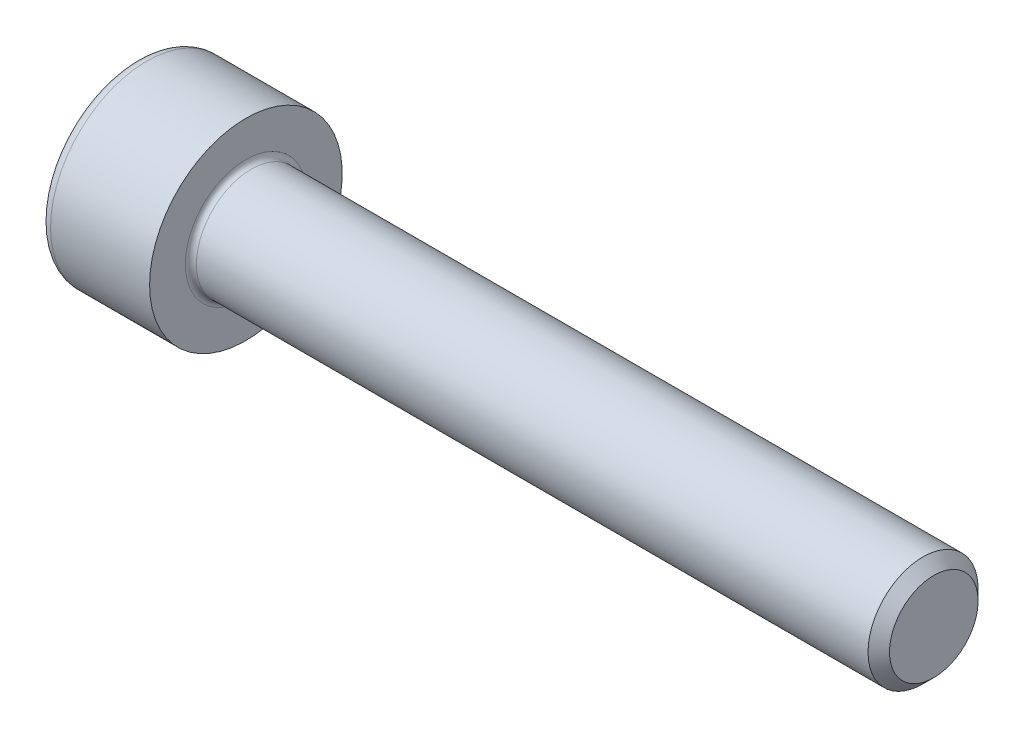
ISO-10303-21;
HEADER;
FILE_DESCRIPTION(('STEP AP214'),'2;1');
FILE_NAME('part.step','',(''),(''),'','','');
FILE_SCHEMA(('AUTOMOTIVE_DESIGN { 1 0 10303 214 1 1 1 1 }'));
ENDSEC;
DATA;
#1=APPLICATION_CONTEXT('core data for automotive mechanical design processes');
#2=APPLICATION_PROTOCOL_DEFINITION('international standard','automotive_design',2000,#1);
#3=PRODUCT_CONTEXT('',#1,'mechanical');
#4=PRODUCT('Part','Part','',(#3));
#5=PRODUCT_RELATED_PRODUCT_CATEGORY('part','',(#4));
#6=PRODUCT_DEFINITION_FORMATION('','',#4);
#7=PRODUCT_DEFINITION_CONTEXT('part definition',#1,'design');
#8=PRODUCT_DEFINITION('design','',#6,#7);
#9=PRODUCT_DEFINITION_SHAPE('','',#8);
#10=(LENGTH_UNIT() NAMED_UNIT(*) SI_UNIT(.MILLI.,.METRE.));
#11=(NAMED_UNIT(*) PLANE_ANGLE_UNIT() SI_UNIT($,.RADIAN.));
#12=(NAMED_UNIT(*) SI_UNIT($,.STERADIAN.) SOLID_ANGLE_UNIT());
#13=UNCERTAINTY_MEASURE_WITH_UNIT(LENGTH_MEASURE(1.E-05),#10,'distance_accuracy_value','');
#14=(GEOMETRIC_REPRESENTATION_CONTEXT(3) GLOBAL_UNCERTAINTY_ASSIGNED_CONTEXT((#13)) GLOBAL_UNIT_ASSIGNED_CONTEXT((#10,
#11,#12)) REPRESENTATION_CONTEXT('',''));
#15=CARTESIAN_POINT('',(0.,0.,0.));
#16=DIRECTION('',(0.,0.,1.));
#17=DIRECTION('',(1.,0.,0.));
#18=AXIS2_PLACEMENT_3D('',#15,#16,#17);
#19=CARTESIAN_POINT('',(0.,0.,0.));
#20=DIRECTION('',(-1.,0.,0.));
#21=DIRECTION('',(0.,0.,1.));
#22=AXIS2_PLACEMENT_3D('',#19,#20,#21);
#23=PLANE('',#22);
#24=DIRECTION('',(0.,-0.5,0.866025403784439));
#25=VECTOR('',#24,1.);
#26=CARTESIAN_POINT('',(0.,1.74359781295267,0.));
#27=LINE('',#26,#25);
#28=CARTESIAN_POINT('',(0.,1.74359781295267,0.));
#29=VERTEX_POINT('',#28);
#30=CARTESIAN_POINT('',(0.,0.871798906476331,1.51));
#31=VERTEX_POINT('',#30);
#32=EDGE_CURVE('E258',#29,#31,#27,.T.);
#33=ORIENTED_EDGE('',*,*,#32,.T.);
#34=DIRECTION('',(0.,1.,0.));
#35=VECTOR('',#34,1.);
#36=CARTESIAN_POINT('',(0.,-0.87179890647634,1.51));
#37=LINE('',#36,#35);
#38=CARTESIAN_POINT('',(0.,-0.87179890647634,1.51));
#39=VERTEX_POINT('',#38);
#40=EDGE_CURVE('E130',#39,#31,#37,.T.);
#41=ORIENTED_EDGE('',*,*,#40,.F.);
#42=DIRECTION('',(0.,-0.500000000000001,-0.866025403784438));
#43=VECTOR('',#42,1.);
#44=CARTESIAN_POINT('',(0.,-0.87179890647634,1.51));
#45=LINE('',#44,#43);
#46=CARTESIAN_POINT('',(0.,-1.74359781295268,0.));
#47=VERTEX_POINT('',#46);
#48=EDGE_CURVE('E261',#39,#47,#45,.T.);
#49=ORIENTED_EDGE('',*,*,#48,.T.);
#50=DIRECTION('',(0.,0.5,-0.866025403784439));
#51=VECTOR('',#50,1.);
#52=CARTESIAN_POINT('',(0.,-1.74359781295268,0.));
#53=LINE('',#52,#51);
#54=CARTESIAN_POINT('',(0.,-0.871798906476342,-1.51));
#55=VERTEX_POINT('',#54);
#56=EDGE_CURVE('E264',#47,#55,#53,.T.);
#57=ORIENTED_EDGE('',*,*,#56,.T.);
#58=DIRECTION('',(0.,-1.,0.));
#59=VECTOR('',#58,1.);
#60=CARTESIAN_POINT('',(0.,0.871798906476328,-1.51));
#61=LINE('',#60,#59);
#62=CARTESIAN_POINT('',(0.,0.871798906476328,-1.51));
#63=VERTEX_POINT('',#62);
#64=EDGE_CURVE('E267',#63,#55,#61,.T.);
#65=ORIENTED_EDGE('',*,*,#64,.F.);
#66=DIRECTION('',(0.,-0.500000000000002,-0.866025403784438));
#67=VECTOR('',#66,1.);
#68=CARTESIAN_POINT('',(0.,1.74359781295267,0.));
#69=LINE('',#68,#67);
#70=EDGE_CURVE('E125',#29,#63,#69,.T.);
#71=ORIENTED_EDGE('',*,*,#70,.F.);
#72=EDGE_LOOP('',(#33,#41,#49,#57,#65,#71));
#73=FACE_BOUND('',#72,.T.);
#74=CARTESIAN_POINT('',(0.,0.,0.));
#75=DIRECTION('',(-1.,0.,0.));
#76=DIRECTION('',(0.,0.,1.));
#77=AXIS2_PLACEMENT_3D('',#74,#75,#76);
#78=CIRCLE('',#77,3.1);
#79=CARTESIAN_POINT('',(0.,0.,3.1));
#80=VERTEX_POINT('',#79);
#81=EDGE_CURVE('E42',#80,#80,#78,.T.);
#82=ORIENTED_EDGE('',*,*,#81,.T.);
#83=EDGE_LOOP('',(#82));
#84=FACE_BOUND('',#83,.T.);
#85=ADVANCED_FACE('F34',(#73,#84),#23,.T.);
#86=CARTESIAN_POINT('',(-31.75,0.,0.));
#87=DIRECTION('',(-1.,0.,0.));
#88=DIRECTION('',(0.,0.,1.));
#89=AXIS2_PLACEMENT_3D('',#86,#87,#88);
#90=CYLINDRICAL_SURFACE('',#89,3.5);
#91=CARTESIAN_POINT('',(0.399999999999998,0.,0.));
#92=DIRECTION('',(-1.,0.,0.));
#93=DIRECTION('',(0.,0.,1.));
#94=AXIS2_PLACEMENT_3D('',#91,#92,#93);
#95=CIRCLE('',#94,3.5);
#96=CARTESIAN_POINT('',(0.399999999999998,0.,3.5));
#97=VERTEX_POINT('',#96);
#98=EDGE_CURVE('E11',#97,#97,#95,.F.);
#99=ORIENTED_EDGE('',*,*,#98,.T.);
#100=EDGE_LOOP('',(#99));
#101=FACE_BOUND('',#100,.T.);
#102=CARTESIAN_POINT('',(4.,0.,0.));
#103=DIRECTION('',(-1.,0.,0.));
#104=DIRECTION('',(0.,0.,1.));
#105=AXIS2_PLACEMENT_3D('',#102,#103,#104);
#106=CIRCLE('',#105,3.5);
#107=CARTESIAN_POINT('',(4.,0.,3.5));
#108=VERTEX_POINT('',#107);
#109=EDGE_CURVE('E148',#108,#108,#106,.T.);
#110=ORIENTED_EDGE('',*,*,#109,.T.);
#111=EDGE_LOOP('',(#110));
#112=FACE_BOUND('',#111,.T.);
#113=ADVANCED_FACE('F172',(#101,#112),#90,.T.);
#114=CARTESIAN_POINT('',(4.,3.5,0.));
#115=DIRECTION('',(1.,0.,0.));
#116=DIRECTION('',(0.,0.,-1.));
#117=AXIS2_PLACEMENT_3D('',#114,#115,#116);
#118=PLANE('',#117);
#119=CARTESIAN_POINT('',(4.,0.,0.));
#120=DIRECTION('',(1.,0.,0.));
#121=DIRECTION('',(0.,0.,-1.));
#122=AXIS2_PLACEMENT_3D('',#119,#120,#121);
#123=CIRCLE('',#122,2.19999999999999);
#124=CARTESIAN_POINT('',(4.,0.,-2.19999999999999));
#125=VERTEX_POINT('',#124);
#126=EDGE_CURVE('E151',#125,#125,#123,.F.);
#127=ORIENTED_EDGE('',*,*,#126,.T.);
#128=EDGE_LOOP('',(#127));
#129=FACE_BOUND('',#128,.T.);
#130=ORIENTED_EDGE('',*,*,#109,.F.);
#131=EDGE_LOOP('',(#130));
#132=FACE_BOUND('',#131,.T.);
#133=ADVANCED_FACE('F178',(#129,#132),#118,.T.);
#134=CARTESIAN_POINT('',(-31.75,0.,0.));
#135=DIRECTION('',(-1.,0.,0.));
#136=DIRECTION('',(0.,0.,1.));
#137=AXIS2_PLACEMENT_3D('',#134,#135,#136);
#138=CYLINDRICAL_SURFACE('',#137,1.99999999999999);
#139=CARTESIAN_POINT('',(4.2,0.,0.));
#140=DIRECTION('',(1.,0.,0.));
#141=DIRECTION('',(0.,0.,-1.));
#142=AXIS2_PLACEMENT_3D('',#139,#140,#141);
#143=CIRCLE('',#142,1.99999999999999);
#144=CARTESIAN_POINT('',(4.2,0.,-1.99999999999999));
#145=VERTEX_POINT('',#144);
#146=EDGE_CURVE('E154',#145,#145,#143,.T.);
#147=ORIENTED_EDGE('',*,*,#146,.T.);
#148=EDGE_LOOP('',(#147));
#149=FACE_BOUND('',#148,.T.);
#150=CARTESIAN_POINT('',(28.61,0.,0.));
#151=DIRECTION('',(-1.,0.,0.));
#152=DIRECTION('',(0.,0.,1.));
#153=AXIS2_PLACEMENT_3D('',#150,#151,#152);
#154=CIRCLE('',#153,1.99999999999998);
#155=CARTESIAN_POINT('',(28.61,0.,1.99999999999998));
#156=VERTEX_POINT('',#155);
#157=EDGE_CURVE('E145',#156,#156,#154,.T.);
#158=ORIENTED_EDGE('',*,*,#157,.T.);
#159=EDGE_LOOP('',(#158));
#160=FACE_BOUND('',#159,.T.);
#161=ADVANCED_FACE('F184',(#149,#160),#138,.T.);
#162=CARTESIAN_POINT('',(29.,0.,0.));
#163=DIRECTION('',(-1.,0.,0.));
#164=DIRECTION('',(0.,0.,1.));
#165=AXIS2_PLACEMENT_3D('',#162,#163,#164);
#166=CONICAL_SURFACE('',#165,1.61,0.785398163397405);
#167=ORIENTED_EDGE('',*,*,#157,.F.);
#168=EDGE_LOOP('',(#167));
#169=FACE_BOUND('',#168,.T.);
#170=CARTESIAN_POINT('',(29.,0.,0.));
#171=DIRECTION('',(-1.,0.,0.));
#172=DIRECTION('',(0.,0.,1.));
#173=AXIS2_PLACEMENT_3D('',#170,#171,#172);
#174=CIRCLE('',#173,1.61);
#175=CARTESIAN_POINT('',(29.,0.,1.61));
#176=VERTEX_POINT('',#175);
#177=EDGE_CURVE('E141',#176,#176,#174,.T.);
#178=ORIENTED_EDGE('',*,*,#177,.T.);
#179=EDGE_LOOP('',(#178));
#180=FACE_BOUND('',#179,.T.);
#181=ADVANCED_FACE('F188',(#169,#180),#166,.T.);
#182=CARTESIAN_POINT('',(29.,1.61,0.));
#183=DIRECTION('',(1.,0.,0.));
#184=DIRECTION('',(0.,0.,-1.));
#185=AXIS2_PLACEMENT_3D('',#182,#183,#184);
#186=PLANE('',#185);
#187=ORIENTED_EDGE('',*,*,#177,.F.);
#188=EDGE_LOOP('',(#187));
#189=FACE_BOUND('',#188,.T.);
#190=ADVANCED_FACE('F168',(#189),#186,.T.);
#191=CARTESIAN_POINT('',(4.2,0.,0.));
#192=DIRECTION('',(1.,0.,0.));
#193=DIRECTION('',(0.,0.,-1.));
#194=AXIS2_PLACEMENT_3D('',#191,#192,#193);
#195=TOROIDAL_SURFACE('',#194,2.19999999999999,0.2);
#196=ORIENTED_EDGE('',*,*,#146,.F.);
#197=EDGE_LOOP('',(#196));
#198=FACE_BOUND('',#197,.T.);
#199=ORIENTED_EDGE('',*,*,#126,.F.);
#200=EDGE_LOOP('',(#199));
#201=FACE_BOUND('',#200,.T.);
#202=ADVANCED_FACE('F161',(#198,#201),#195,.F.);
#203=CARTESIAN_POINT('',(0.399999999999998,0.,0.));
#204=DIRECTION('',(-1.,0.,0.));
#205=DIRECTION('',(0.,0.,1.));
#206=AXIS2_PLACEMENT_3D('',#203,#204,#205);
#207=TOROIDAL_SURFACE('',#206,3.1,0.4);
#208=ORIENTED_EDGE('',*,*,#98,.F.);
#209=EDGE_LOOP('',(#208));
#210=FACE_BOUND('',#209,.T.);
#211=ORIENTED_EDGE('',*,*,#81,.F.);
#212=EDGE_LOOP('',(#211));
#213=FACE_BOUND('',#212,.T.);
#214=ADVANCED_FACE('F36',(#210,#213),#207,.T.);
#215=CARTESIAN_POINT('',(2.,1.74359781295267,0.));
#216=DIRECTION('',(0.,-0.866025403784439,-0.5));
#217=DIRECTION('',(0.,0.5,-0.866025403784439));
#218=AXIS2_PLACEMENT_3D('',#215,#216,#217);
#219=PLANE('',#218);
#220=ORIENTED_EDGE('',*,*,#32,.F.);
#221=DIRECTION('',(-1.,0.,0.));
#222=VECTOR('',#221,1.);
#223=CARTESIAN_POINT('',(2.,1.74359781295267,0.));
#224=LINE('',#223,#222);
#225=CARTESIAN_POINT('',(2.,1.74359781295267,0.));
#226=VERTEX_POINT('',#225);
#227=EDGE_CURVE('E248',#226,#29,#224,.T.);
#228=ORIENTED_EDGE('',*,*,#227,.F.);
#229=DIRECTION('',(0.,-0.5,0.866025403784439));
#230=VECTOR('',#229,1.);
#231=CARTESIAN_POINT('',(2.,1.74359781295267,0.));
#232=LINE('',#231,#230);
#233=CARTESIAN_POINT('',(2.,1.3076983597145,0.754999999999997));
#234=VERTEX_POINT('',#233);
#235=EDGE_CURVE('E117',#226,#234,#232,.T.);
#236=ORIENTED_EDGE('',*,*,#235,.T.);
#237=CARTESIAN_POINT('',(2.,0.871798906476331,1.51));
#238=VERTEX_POINT('',#237);
#239=EDGE_CURVE('E108',#234,#238,#232,.T.);
#240=ORIENTED_EDGE('',*,*,#239,.T.);
#241=DIRECTION('',(-1.,0.,0.));
#242=VECTOR('',#241,1.);
#243=CARTESIAN_POINT('',(2.,0.871798906476331,1.51));
#244=LINE('',#243,#242);
#245=EDGE_CURVE('E122',#238,#31,#244,.T.);
#246=ORIENTED_EDGE('',*,*,#245,.T.);
#247=EDGE_LOOP('',(#220,#228,#236,#240,#246));
#248=FACE_BOUND('',#247,.T.);
#249=ADVANCED_FACE('F121',(#248),#219,.T.);
#250=CARTESIAN_POINT('',(2.,-0.87179890647634,1.51));
#251=DIRECTION('',(0.,0.,1.));
#252=DIRECTION('',(0.,-1.,0.));
#253=AXIS2_PLACEMENT_3D('',#250,#251,#252);
#254=PLANE('',#253);
#255=ORIENTED_EDGE('',*,*,#40,.T.);
#256=ORIENTED_EDGE('',*,*,#245,.F.);
#257=DIRECTION('',(0.,1.,0.));
#258=VECTOR('',#257,1.);
#259=CARTESIAN_POINT('',(2.,-0.87179890647634,1.51));
#260=LINE('',#259,#258);
#261=CARTESIAN_POINT('',(2.,0.,1.51));
#262=VERTEX_POINT('',#261);
#263=EDGE_CURVE('E105',#262,#238,#260,.T.);
#264=ORIENTED_EDGE('',*,*,#263,.F.);
#265=CARTESIAN_POINT('',(2.,-0.87179890647634,1.51));
#266=VERTEX_POINT('',#265);
#267=EDGE_CURVE('E116',#266,#262,#260,.T.);
#268=ORIENTED_EDGE('',*,*,#267,.F.);
#269=DIRECTION('',(-1.,0.,0.));
#270=VECTOR('',#269,1.);
#271=CARTESIAN_POINT('',(2.,-0.87179890647634,1.51));
#272=LINE('',#271,#270);
#273=EDGE_CURVE('E132',#266,#39,#272,.T.);
#274=ORIENTED_EDGE('',*,*,#273,.T.);
#275=EDGE_LOOP('',(#255,#256,#264,#268,#274));
#276=FACE_BOUND('',#275,.T.);
#277=ADVANCED_FACE('F127',(#276),#254,.F.);
#278=CARTESIAN_POINT('',(2.,-0.87179890647634,1.51));
#279=DIRECTION('',(0.,0.866025403784438,-0.500000000000001));
#280=DIRECTION('',(0.,0.500000000000001,0.866025403784438));
#281=AXIS2_PLACEMENT_3D('',#278,#279,#280);
#282=PLANE('',#281);
#283=ORIENTED_EDGE('',*,*,#48,.F.);
#284=ORIENTED_EDGE('',*,*,#273,.F.);
#285=DIRECTION('',(0.,-0.500000000000001,-0.866025403784438));
#286=VECTOR('',#285,1.);
#287=CARTESIAN_POINT('',(2.,-0.87179890647634,1.51));
#288=LINE('',#287,#286);
#289=CARTESIAN_POINT('',(2.,-1.30769835971451,0.755000000000004));
#290=VERTEX_POINT('',#289);
#291=EDGE_CURVE('E287',#266,#290,#288,.T.);
#292=ORIENTED_EDGE('',*,*,#291,.T.);
#293=CARTESIAN_POINT('',(2.,-1.74359781295268,0.));
#294=VERTEX_POINT('',#293);
#295=EDGE_CURVE('E276',#290,#294,#288,.T.);
#296=ORIENTED_EDGE('',*,*,#295,.T.);
#297=DIRECTION('',(-1.,0.,0.));
#298=VECTOR('',#297,1.);
#299=CARTESIAN_POINT('',(2.,-1.74359781295268,0.));
#300=LINE('',#299,#298);
#301=EDGE_CURVE('E137',#294,#47,#300,.T.);
#302=ORIENTED_EDGE('',*,*,#301,.T.);
#303=EDGE_LOOP('',(#283,#284,#292,#296,#302));
#304=FACE_BOUND('',#303,.T.);
#305=ADVANCED_FACE('F202',(#304),#282,.T.);
#306=CARTESIAN_POINT('',(2.,-1.74359781295268,0.));
#307=DIRECTION('',(0.,0.866025403784439,0.499999999999999));
#308=DIRECTION('',(0.,-0.499999999999999,0.866025403784439));
#309=AXIS2_PLACEMENT_3D('',#306,#307,#308);
#310=PLANE('',#309);
#311=ORIENTED_EDGE('',*,*,#56,.F.);
#312=ORIENTED_EDGE('',*,*,#301,.F.);
#313=DIRECTION('',(0.,0.5,-0.866025403784439));
#314=VECTOR('',#313,1.);
#315=CARTESIAN_POINT('',(2.,-1.74359781295268,0.));
#316=LINE('',#315,#314);
#317=CARTESIAN_POINT('',(2.,-1.30769835971451,-0.755000000000002));
#318=VERTEX_POINT('',#317);
#319=EDGE_CURVE('E254',#294,#318,#316,.T.);
#320=ORIENTED_EDGE('',*,*,#319,.T.);
#321=CARTESIAN_POINT('',(2.,-0.871798906476342,-1.51));
#322=VERTEX_POINT('',#321);
#323=EDGE_CURVE('E286',#318,#322,#316,.T.);
#324=ORIENTED_EDGE('',*,*,#323,.T.);
#325=DIRECTION('',(-1.,0.,0.));
#326=VECTOR('',#325,1.);
#327=CARTESIAN_POINT('',(2.,-0.871798906476342,-1.51));
#328=LINE('',#327,#326);
#329=EDGE_CURVE('E247',#322,#55,#328,.T.);
#330=ORIENTED_EDGE('',*,*,#329,.T.);
#331=EDGE_LOOP('',(#311,#312,#320,#324,#330));
#332=FACE_BOUND('',#331,.T.);
#333=ADVANCED_FACE('F205',(#332),#310,.T.);
#334=CARTESIAN_POINT('',(2.,0.871798906476328,-1.51));
#335=DIRECTION('',(0.,0.,-1.));
#336=DIRECTION('',(0.,1.,0.));
#337=AXIS2_PLACEMENT_3D('',#334,#335,#336);
#338=PLANE('',#337);
#339=ORIENTED_EDGE('',*,*,#64,.T.);
#340=ORIENTED_EDGE('',*,*,#329,.F.);
#341=DIRECTION('',(0.,-1.,0.));
#342=VECTOR('',#341,1.);
#343=CARTESIAN_POINT('',(2.,0.871798906476328,-1.51));
#344=LINE('',#343,#342);
#345=CARTESIAN_POINT('',(2.,0.,-1.51));
#346=VERTEX_POINT('',#345);
#347=EDGE_CURVE('E251',#346,#322,#344,.T.);
#348=ORIENTED_EDGE('',*,*,#347,.F.);
#349=CARTESIAN_POINT('',(2.,0.871798906476328,-1.51));
#350=VERTEX_POINT('',#349);
#351=EDGE_CURVE('E49',#350,#346,#344,.T.);
#352=ORIENTED_EDGE('',*,*,#351,.F.);
#353=DIRECTION('',(-1.,0.,0.));
#354=VECTOR('',#353,1.);
#355=CARTESIAN_POINT('',(2.,0.871798906476328,-1.51));
#356=LINE('',#355,#354);
#357=EDGE_CURVE('E244',#350,#63,#356,.T.);
#358=ORIENTED_EDGE('',*,*,#357,.T.);
#359=EDGE_LOOP('',(#339,#340,#348,#352,#358));
#360=FACE_BOUND('',#359,.T.);
#361=ADVANCED_FACE('F209',(#360),#338,.F.);
#362=CARTESIAN_POINT('',(2.,1.74359781295267,0.));
#363=DIRECTION('',(0.,0.866025403784438,-0.500000000000002));
#364=DIRECTION('',(0.,0.500000000000002,0.866025403784438));
#365=AXIS2_PLACEMENT_3D('',#362,#363,#364);
#366=PLANE('',#365);
#367=ORIENTED_EDGE('',*,*,#70,.T.);
#368=ORIENTED_EDGE('',*,*,#357,.F.);
#369=DIRECTION('',(0.,-0.500000000000002,-0.866025403784438));
#370=VECTOR('',#369,1.);
#371=CARTESIAN_POINT('',(2.,1.74359781295267,0.));
#372=LINE('',#371,#370);
#373=CARTESIAN_POINT('',(2.,1.3076983597145,-0.755000000000001));
#374=VERTEX_POINT('',#373);
#375=EDGE_CURVE('E234',#374,#350,#372,.T.);
#376=ORIENTED_EDGE('',*,*,#375,.F.);
#377=EDGE_CURVE('E240',#226,#374,#372,.T.);
#378=ORIENTED_EDGE('',*,*,#377,.F.);
#379=ORIENTED_EDGE('',*,*,#227,.T.);
#380=EDGE_LOOP('',(#367,#368,#376,#378,#379));
#381=FACE_BOUND('',#380,.T.);
#382=ADVANCED_FACE('F213',(#381),#366,.F.);
#383=CARTESIAN_POINT('',(2.,1.74359781295267,0.));
#384=DIRECTION('',(1.,0.,0.));
#385=DIRECTION('',(0.,0.,-1.));
#386=AXIS2_PLACEMENT_3D('',#383,#384,#385);
#387=PLANE('',#386);
#388=ORIENTED_EDGE('',*,*,#347,.T.);
#389=ORIENTED_EDGE('',*,*,#323,.F.);
#390=CARTESIAN_POINT('',(2.,0.,0.));
#391=DIRECTION('',(-1.,0.,0.));
#392=DIRECTION('',(0.,0.,1.));
#393=AXIS2_PLACEMENT_3D('',#390,#391,#392);
#394=CIRCLE('',#393,1.51);
#395=EDGE_CURVE('E282',#346,#318,#394,.T.);
#396=ORIENTED_EDGE('',*,*,#395,.F.);
#397=EDGE_LOOP('',(#388,#389,#396));
#398=FACE_BOUND('',#397,.T.);
#399=ADVANCED_FACE('F217',(#398),#387,.F.);
#400=ORIENTED_EDGE('',*,*,#319,.F.);
#401=ORIENTED_EDGE('',*,*,#295,.F.);
#402=EDGE_CURVE('E135',#318,#290,#394,.T.);
#403=ORIENTED_EDGE('',*,*,#402,.F.);
#404=EDGE_LOOP('',(#400,#401,#403));
#405=FACE_BOUND('',#404,.T.);
#406=ADVANCED_FACE('F220',(#405),#387,.F.);
#407=ORIENTED_EDGE('',*,*,#291,.F.);
#408=ORIENTED_EDGE('',*,*,#267,.T.);
#409=EDGE_CURVE('E131',#290,#262,#394,.T.);
#410=ORIENTED_EDGE('',*,*,#409,.F.);
#411=EDGE_LOOP('',(#407,#408,#410));
#412=FACE_BOUND('',#411,.T.);
#413=ADVANCED_FACE('F225',(#412),#387,.F.);
#414=ORIENTED_EDGE('',*,*,#263,.T.);
#415=ORIENTED_EDGE('',*,*,#239,.F.);
#416=EDGE_CURVE('E111',#262,#234,#394,.T.);
#417=ORIENTED_EDGE('',*,*,#416,.F.);
#418=EDGE_LOOP('',(#414,#415,#417));
#419=FACE_BOUND('',#418,.T.);
#420=ADVANCED_FACE('F107',(#419),#387,.F.);
#421=ORIENTED_EDGE('',*,*,#235,.F.);
#422=ORIENTED_EDGE('',*,*,#377,.T.);
#423=EDGE_CURVE('E142',#234,#374,#394,.T.);
#424=ORIENTED_EDGE('',*,*,#423,.F.);
#425=EDGE_LOOP('',(#421,#422,#424));
#426=FACE_BOUND('',#425,.T.);
#427=ADVANCED_FACE('F228',(#426),#387,.F.);
#428=ORIENTED_EDGE('',*,*,#375,.T.);
#429=ORIENTED_EDGE('',*,*,#351,.T.);
#430=EDGE_CURVE('E237',#374,#346,#394,.T.);
#431=ORIENTED_EDGE('',*,*,#430,.F.);
#432=EDGE_LOOP('',(#428,#429,#431));
#433=FACE_BOUND('',#432,.T.);
#434=ADVANCED_FACE('F198',(#433),#387,.F.);
#435=CARTESIAN_POINT('',(2.,0.,0.));
#436=DIRECTION('',(-1.,0.,0.));
#437=DIRECTION('',(0.,0.,1.));
#438=AXIS2_PLACEMENT_3D('',#435,#436,#437);
#439=CONICAL_SURFACE('',#438,1.51,1.04719755119659);
#440=CARTESIAN_POINT('',(2.87179890647635,0.,0.));
#441=VERTEX_POINT('',#440);
#442=VERTEX_LOOP('',#441);
#443=FACE_BOUND('',#442,.T.);
#444=ORIENTED_EDGE('',*,*,#416,.T.);
#445=ORIENTED_EDGE('',*,*,#423,.T.);
#446=ORIENTED_EDGE('',*,*,#430,.T.);
#447=ORIENTED_EDGE('',*,*,#395,.T.);
#448=ORIENTED_EDGE('',*,*,#402,.T.);
#449=ORIENTED_EDGE('',*,*,#409,.T.);
#450=EDGE_LOOP('',(#444,#445,#446,#447,#448,#449));
#451=FACE_BOUND('',#450,.T.);
#452=ADVANCED_FACE('F196',(#443,#451),#439,.F.);
#453=CLOSED_SHELL('',(#85,#113,#133,#161,#181,#190,#202,#214,#249,#277,#305,#333,#361,#382,#399,
#406,#413,#420,#427,#434,#452));
#454=MANIFOLD_SOLID_BREP('B2',#453);
#455=ADVANCED_BREP_SHAPE_REPRESENTATION('',(#18,#454),#14);
#456=SHAPE_DEFINITION_REPRESENTATION(#9,#455);
ENDSEC;
END-ISO-10303-21;
